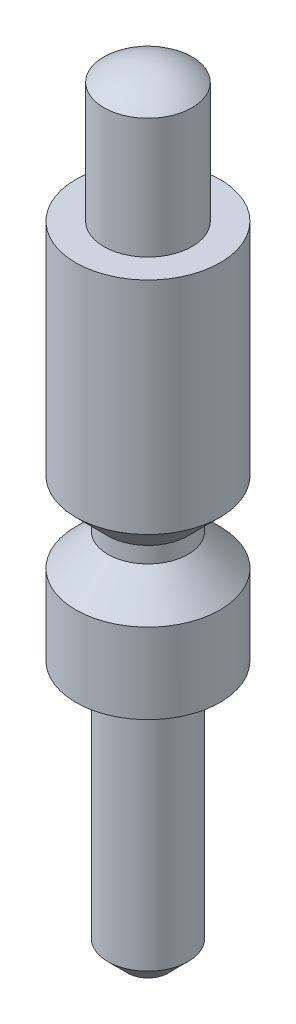
ISO-10303-21;
HEADER;
FILE_DESCRIPTION(('STEP AP214'),'2;1');
FILE_NAME('part.step','',(''),(''),'','','');
FILE_SCHEMA(('AUTOMOTIVE_DESIGN { 1 0 10303 214 1 1 1 1 }'));
ENDSEC;
DATA;
#1=APPLICATION_CONTEXT('core data for automotive mechanical design processes');
#2=APPLICATION_PROTOCOL_DEFINITION('international standard','automotive_design',2000,#1);
#3=PRODUCT_CONTEXT('',#1,'mechanical');
#4=PRODUCT('Part','Part','',(#3));
#5=PRODUCT_RELATED_PRODUCT_CATEGORY('part','',(#4));
#6=PRODUCT_DEFINITION_FORMATION('','',#4);
#7=PRODUCT_DEFINITION_CONTEXT('part definition',#1,'design');
#8=PRODUCT_DEFINITION('design','',#6,#7);
#9=PRODUCT_DEFINITION_SHAPE('','',#8);
#10=(LENGTH_UNIT() NAMED_UNIT(*) SI_UNIT(.MILLI.,.METRE.));
#11=(NAMED_UNIT(*) PLANE_ANGLE_UNIT() SI_UNIT($,.RADIAN.));
#12=(NAMED_UNIT(*) SI_UNIT($,.STERADIAN.) SOLID_ANGLE_UNIT());
#13=UNCERTAINTY_MEASURE_WITH_UNIT(LENGTH_MEASURE(1.E-05),#10,'distance_accuracy_value','');
#14=(GEOMETRIC_REPRESENTATION_CONTEXT(3) GLOBAL_UNCERTAINTY_ASSIGNED_CONTEXT((#13)) GLOBAL_UNIT_ASSIGNED_CONTEXT((#10,
#11,#12)) REPRESENTATION_CONTEXT('',''));
#15=CARTESIAN_POINT('',(0.,0.,0.));
#16=DIRECTION('',(0.,0.,1.));
#17=DIRECTION('',(1.,0.,0.));
#18=AXIS2_PLACEMENT_3D('',#15,#16,#17);
#19=CARTESIAN_POINT('',(33.072717540733,-5.552019390202,-23.43448402181));
#20=DIRECTION('',(0.,-1.,0.));
#21=DIRECTION('',(0.,0.,-1.));
#22=AXIS2_PLACEMENT_3D('',#19,#20,#21);
#23=PLANE('',#22);
#24=CARTESIAN_POINT('',(32.822717540733,-5.5520193901657,-23.43448402181));
#25=DIRECTION('',(0.,1.,0.));
#26=DIRECTION('',(0.,0.,1.));
#27=AXIS2_PLACEMENT_3D('',#24,#25,#26);
#28=CIRCLE('',#27,0.250000000026809);
#29=CARTESIAN_POINT('',(32.822717540733,-5.5520193901657,-23.1844840217832));
#30=VERTEX_POINT('',#29);
#31=EDGE_CURVE('E18',#30,#30,#28,.T.);
#32=ORIENTED_EDGE('',*,*,#31,.F.);
#33=EDGE_LOOP('',(#32));
#34=FACE_BOUND('',#33,.T.);
#35=ADVANCED_FACE('F15',(#34),#23,.T.);
#36=CARTESIAN_POINT('',(32.822717540733,-5.30201939011476,-23.43448402181));
#37=DIRECTION('',(0.,1.,0.));
#38=DIRECTION('',(0.,0.,1.));
#39=AXIS2_PLACEMENT_3D('',#36,#37,#38);
#40=CONICAL_SURFACE('',#39,0.500000000134584,0.785398163511135);
#41=ORIENTED_EDGE('',*,*,#31,.T.);
#42=EDGE_LOOP('',(#41));
#43=FACE_BOUND('',#42,.T.);
#44=CARTESIAN_POINT('',(32.822717540733,-5.302019390202,-23.43448402181));
#45=DIRECTION('',(0.,1.,0.));
#46=DIRECTION('',(0.,0.,1.));
#47=AXIS2_PLACEMENT_3D('',#44,#45,#46);
#48=CIRCLE('',#47,0.5);
#49=CARTESIAN_POINT('',(32.822717540733,-5.302019390202,-22.93448402181));
#50=VERTEX_POINT('',#49);
#51=EDGE_CURVE('E35',#50,#50,#48,.T.);
#52=ORIENTED_EDGE('',*,*,#51,.F.);
#53=EDGE_LOOP('',(#52));
#54=FACE_BOUND('',#53,.T.);
#55=ADVANCED_FACE('F55',(#43,#54),#40,.T.);
#56=CARTESIAN_POINT('',(32.822717540733,2.447980609798,-23.43448402181));
#57=DIRECTION('',(0.,1.,0.));
#58=DIRECTION('',(0.,0.,1.));
#59=AXIS2_PLACEMENT_3D('',#56,#57,#58);
#60=CYLINDRICAL_SURFACE('',#59,0.5);
#61=CARTESIAN_POINT('',(32.822717540733,-2.302019390202,-23.43448402181));
#62=DIRECTION('',(0.,1.,0.));
#63=DIRECTION('',(0.,0.,1.));
#64=AXIS2_PLACEMENT_3D('',#61,#62,#63);
#65=CIRCLE('',#64,0.5);
#66=CARTESIAN_POINT('',(32.822717540733,-2.302019390202,-22.93448402181));
#67=VERTEX_POINT('',#66);
#68=EDGE_CURVE('E106',#67,#67,#65,.T.);
#69=ORIENTED_EDGE('',*,*,#68,.F.);
#70=EDGE_LOOP('',(#69));
#71=FACE_BOUND('',#70,.T.);
#72=ORIENTED_EDGE('',*,*,#51,.T.);
#73=EDGE_LOOP('',(#72));
#74=FACE_BOUND('',#73,.T.);
#75=ADVANCED_FACE('F52',(#71,#74),#60,.T.);
#76=CARTESIAN_POINT('',(33.722717540733,-2.302019390202,-23.43448402181));
#77=DIRECTION('',(0.,-1.,0.));
#78=DIRECTION('',(0.,0.,-1.));
#79=AXIS2_PLACEMENT_3D('',#76,#77,#78);
#80=PLANE('',#79);
#81=ORIENTED_EDGE('',*,*,#68,.T.);
#82=EDGE_LOOP('',(#81));
#83=FACE_BOUND('',#82,.T.);
#84=CARTESIAN_POINT('',(32.822717540733,-2.302019390202,-23.43448402181));
#85=DIRECTION('',(0.,1.,0.));
#86=DIRECTION('',(0.,0.,1.));
#87=AXIS2_PLACEMENT_3D('',#84,#85,#86);
#88=CIRCLE('',#87,0.9);
#89=CARTESIAN_POINT('',(32.822717540733,-2.302019390202,-22.53448402181));
#90=VERTEX_POINT('',#89);
#91=EDGE_CURVE('E104',#90,#90,#88,.T.);
#92=ORIENTED_EDGE('',*,*,#91,.F.);
#93=EDGE_LOOP('',(#92));
#94=FACE_BOUND('',#93,.T.);
#95=ADVANCED_FACE('F48',(#83,#94),#80,.T.);
#96=CARTESIAN_POINT('',(32.822717540733,2.447980609798,-23.43448402181));
#97=DIRECTION('',(0.,1.,0.));
#98=DIRECTION('',(0.,0.,1.));
#99=AXIS2_PLACEMENT_3D('',#96,#97,#98);
#100=CYLINDRICAL_SURFACE('',#99,0.9);
#101=CARTESIAN_POINT('',(32.822717540733,-1.30201939020935,-23.43448402181));
#102=DIRECTION('',(0.,-1.,0.));
#103=DIRECTION('',(0.,0.,-1.));
#104=AXIS2_PLACEMENT_3D('',#101,#102,#103);
#105=CIRCLE('',#104,0.899999999968735);
#106=CARTESIAN_POINT('',(32.822717540733,-1.30201939020935,-24.3344840217787));
#107=VERTEX_POINT('',#106);
#108=EDGE_CURVE('E103',#107,#107,#105,.F.);
#109=ORIENTED_EDGE('',*,*,#108,.F.);
#110=EDGE_LOOP('',(#109));
#111=FACE_BOUND('',#110,.T.);
#112=ORIENTED_EDGE('',*,*,#91,.T.);
#113=EDGE_LOOP('',(#112));
#114=FACE_BOUND('',#113,.T.);
#115=ADVANCED_FACE('F43',(#111,#114),#100,.T.);
#116=CARTESIAN_POINT('',(32.822717540733,3.291730609798,-23.43448402181));
#117=DIRECTION('',(1.,0.,0.));
#118=DIRECTION('',(0.,1.,0.));
#119=AXIS2_PLACEMENT_3D('',#116,#117,#118);
#120=SPHERICAL_SURFACE('',#119,0.85625);
#121=CARTESIAN_POINT('',(32.822717540733,3.947980609798,-23.43448402181));
#122=DIRECTION('',(0.,1.,0.));
#123=DIRECTION('',(0.,0.,1.));
#124=AXIS2_PLACEMENT_3D('',#121,#122,#123);
#125=CIRCLE('',#124,0.55);
#126=CARTESIAN_POINT('',(32.822717540733,3.947980609798,-22.88448402181));
#127=VERTEX_POINT('',#126);
#128=EDGE_CURVE('E94',#127,#127,#125,.F.);
#129=ORIENTED_EDGE('',*,*,#128,.F.);
#130=EDGE_LOOP('',(#129));
#131=FACE_BOUND('',#130,.T.);
#132=ADVANCED_FACE('F38',(#131),#120,.T.);
#133=CARTESIAN_POINT('',(32.822717540733,-1.30201939020935,-23.43448402181));
#134=DIRECTION('',(0.,-1.,0.));
#135=DIRECTION('',(0.,0.,-1.));
#136=AXIS2_PLACEMENT_3D('',#133,#134,#135);
#137=CONICAL_SURFACE('',#136,0.899999999968735,0.785398163326394);
#138=CARTESIAN_POINT('',(32.822717540733,-0.902019390202,-23.43448402181));
#139=DIRECTION('',(0.,1.,0.));
#140=DIRECTION('',(0.,0.,1.));
#141=AXIS2_PLACEMENT_3D('',#138,#139,#140);
#142=CIRCLE('',#141,0.5);
#143=CARTESIAN_POINT('',(32.822717540733,-0.902019390202,-22.93448402181));
#144=VERTEX_POINT('',#143);
#145=EDGE_CURVE('E97',#144,#144,#142,.T.);
#146=ORIENTED_EDGE('',*,*,#145,.F.);
#147=EDGE_LOOP('',(#146));
#148=FACE_BOUND('',#147,.T.);
#149=ORIENTED_EDGE('',*,*,#108,.T.);
#150=EDGE_LOOP('',(#149));
#151=FACE_BOUND('',#150,.T.);
#152=ADVANCED_FACE('F42',(#148,#151),#137,.T.);
#153=CARTESIAN_POINT('',(32.822717540733,2.447980609798,-23.43448402181));
#154=DIRECTION('',(0.,1.,0.));
#155=DIRECTION('',(0.,0.,1.));
#156=AXIS2_PLACEMENT_3D('',#153,#154,#155);
#157=CYLINDRICAL_SURFACE('',#156,0.55);
#158=ORIENTED_EDGE('',*,*,#128,.T.);
#159=EDGE_LOOP('',(#158));
#160=FACE_BOUND('',#159,.T.);
#161=CARTESIAN_POINT('',(32.822717540733,2.447980609798,-23.43448402181));
#162=DIRECTION('',(0.,1.,0.));
#163=DIRECTION('',(0.,0.,1.));
#164=AXIS2_PLACEMENT_3D('',#161,#162,#163);
#165=CIRCLE('',#164,0.55);
#166=CARTESIAN_POINT('',(32.822717540733,2.447980609798,-22.88448402181));
#167=VERTEX_POINT('',#166);
#168=EDGE_CURVE('E32',#167,#167,#165,.F.);
#169=ORIENTED_EDGE('',*,*,#168,.F.);
#170=EDGE_LOOP('',(#169));
#171=FACE_BOUND('',#170,.T.);
#172=ADVANCED_FACE('F83',(#160,#171),#157,.T.);
#173=CARTESIAN_POINT('',(32.822717540733,2.447980609798,-23.43448402181));
#174=DIRECTION('',(0.,1.,0.));
#175=DIRECTION('',(0.,0.,1.));
#176=AXIS2_PLACEMENT_3D('',#173,#174,#175);
#177=CYLINDRICAL_SURFACE('',#176,0.5);
#178=ORIENTED_EDGE('',*,*,#145,.T.);
#179=EDGE_LOOP('',(#178));
#180=FACE_BOUND('',#179,.T.);
#181=CARTESIAN_POINT('',(32.822717540733,-0.702019390189434,-23.43448402181));
#182=DIRECTION('',(0.,1.,0.));
#183=DIRECTION('',(0.,0.,1.));
#184=AXIS2_PLACEMENT_3D('',#181,#182,#183);
#185=CIRCLE('',#184,0.500000000020897);
#186=CARTESIAN_POINT('',(32.822717540733,-0.702019390189434,-22.9344840217891));
#187=VERTEX_POINT('',#186);
#188=EDGE_CURVE('E27',#187,#187,#185,.T.);
#189=ORIENTED_EDGE('',*,*,#188,.F.);
#190=EDGE_LOOP('',(#189));
#191=FACE_BOUND('',#190,.T.);
#192=ADVANCED_FACE('F80',(#180,#191),#177,.T.);
#193=CARTESIAN_POINT('',(33.372717540733,2.447980609798,-23.43448402181));
#194=DIRECTION('',(0.,1.,0.));
#195=DIRECTION('',(0.,0.,1.));
#196=AXIS2_PLACEMENT_3D('',#193,#194,#195);
#197=PLANE('',#196);
#198=ORIENTED_EDGE('',*,*,#168,.T.);
#199=EDGE_LOOP('',(#198));
#200=FACE_BOUND('',#199,.T.);
#201=CARTESIAN_POINT('',(32.822717540733,2.447980609798,-23.43448402181));
#202=DIRECTION('',(0.,1.,0.));
#203=DIRECTION('',(0.,0.,1.));
#204=AXIS2_PLACEMENT_3D('',#201,#202,#203);
#205=CIRCLE('',#204,0.9);
#206=CARTESIAN_POINT('',(32.822717540733,2.447980609798,-22.53448402181));
#207=VERTEX_POINT('',#206);
#208=EDGE_CURVE('E22',#207,#207,#205,.F.);
#209=ORIENTED_EDGE('',*,*,#208,.F.);
#210=EDGE_LOOP('',(#209));
#211=FACE_BOUND('',#210,.T.);
#212=ADVANCED_FACE('F73',(#200,#211),#197,.T.);
#213=CARTESIAN_POINT('',(32.822717540733,-0.302019390232999,-23.43448402181));
#214=DIRECTION('',(0.,1.,0.));
#215=DIRECTION('',(0.,0.,1.));
#216=AXIS2_PLACEMENT_3D('',#213,#214,#215);
#217=CONICAL_SURFACE('',#216,0.899999999977332,0.785398163397448);
#218=CARTESIAN_POINT('',(32.822717540733,-0.302019390202,-23.43448402181));
#219=DIRECTION('',(0.,1.,0.));
#220=DIRECTION('',(0.,0.,1.));
#221=AXIS2_PLACEMENT_3D('',#218,#219,#220);
#222=CIRCLE('',#221,0.9);
#223=CARTESIAN_POINT('',(32.822717540733,-0.302019390202,-22.53448402181));
#224=VERTEX_POINT('',#223);
#225=EDGE_CURVE('E10',#224,#224,#222,.T.);
#226=ORIENTED_EDGE('',*,*,#225,.F.);
#227=EDGE_LOOP('',(#226));
#228=FACE_BOUND('',#227,.T.);
#229=ORIENTED_EDGE('',*,*,#188,.T.);
#230=EDGE_LOOP('',(#229));
#231=FACE_BOUND('',#230,.T.);
#232=ADVANCED_FACE('F68',(#228,#231),#217,.T.);
#233=CARTESIAN_POINT('',(32.822717540733,2.447980609798,-23.43448402181));
#234=DIRECTION('',(0.,1.,0.));
#235=DIRECTION('',(0.,0.,1.));
#236=AXIS2_PLACEMENT_3D('',#233,#234,#235);
#237=CYLINDRICAL_SURFACE('',#236,0.9);
#238=ORIENTED_EDGE('',*,*,#225,.T.);
#239=EDGE_LOOP('',(#238));
#240=FACE_BOUND('',#239,.T.);
#241=ORIENTED_EDGE('',*,*,#208,.T.);
#242=EDGE_LOOP('',(#241));
#243=FACE_BOUND('',#242,.T.);
#244=ADVANCED_FACE('F66',(#240,#243),#237,.T.);
#245=CLOSED_SHELL('',(#35,#55,#75,#95,#115,#132,#152,#172,#192,#212,#232,#244));
#246=MANIFOLD_SOLID_BREP('B1',#245);
#247=ADVANCED_BREP_SHAPE_REPRESENTATION('',(#18,#246),#14);
#248=SHAPE_DEFINITION_REPRESENTATION(#9,#247);
ENDSEC;
END-ISO-10303-21;
